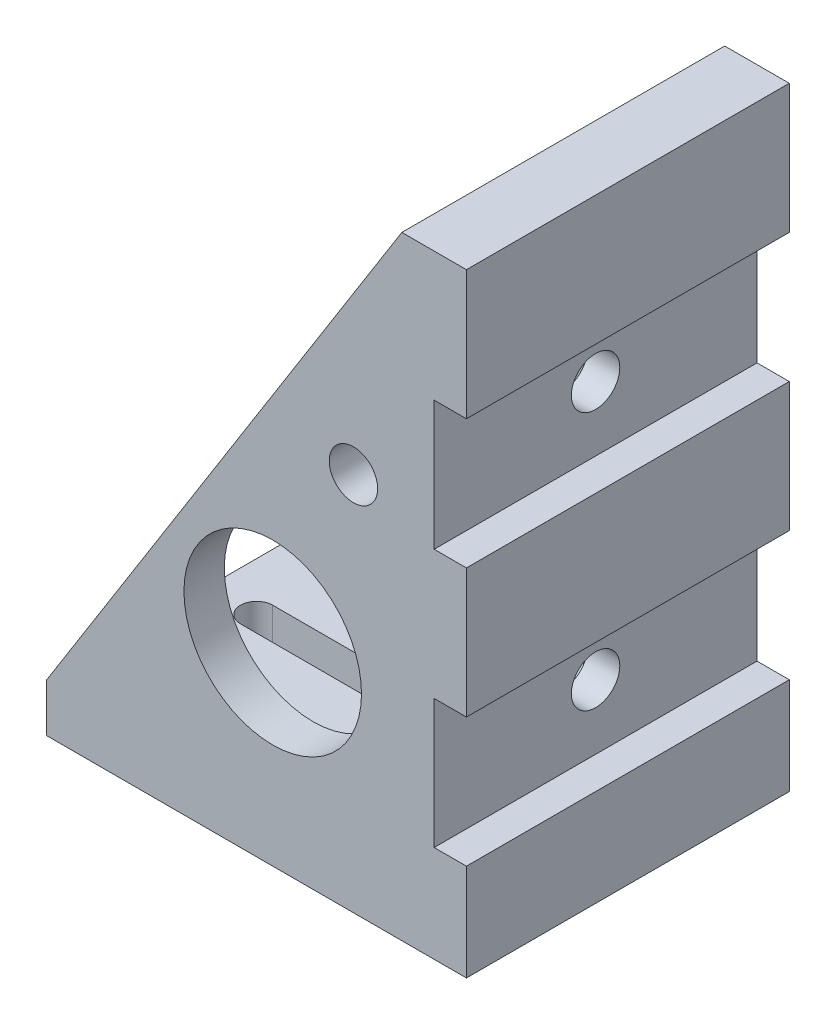
ISO-10303-21;
HEADER;
FILE_DESCRIPTION(('STEP AP214'),'2;1');
FILE_NAME('part.step','',(''),(''),'','','');
FILE_SCHEMA(('AUTOMOTIVE_DESIGN { 1 0 10303 214 1 1 1 1 }'));
ENDSEC;
DATA;
#1=APPLICATION_CONTEXT('core data for automotive mechanical design processes');
#2=APPLICATION_PROTOCOL_DEFINITION('international standard','automotive_design',2000,#1);
#3=PRODUCT_CONTEXT('',#1,'mechanical');
#4=PRODUCT('Part','Part','',(#3));
#5=PRODUCT_RELATED_PRODUCT_CATEGORY('part','',(#4));
#6=PRODUCT_DEFINITION_FORMATION('','',#4);
#7=PRODUCT_DEFINITION_CONTEXT('part definition',#1,'design');
#8=PRODUCT_DEFINITION('design','',#6,#7);
#9=PRODUCT_DEFINITION_SHAPE('','',#8);
#10=(LENGTH_UNIT() NAMED_UNIT(*) SI_UNIT(.MILLI.,.METRE.));
#11=(NAMED_UNIT(*) PLANE_ANGLE_UNIT() SI_UNIT($,.RADIAN.));
#12=(NAMED_UNIT(*) SI_UNIT($,.STERADIAN.) SOLID_ANGLE_UNIT());
#13=UNCERTAINTY_MEASURE_WITH_UNIT(LENGTH_MEASURE(1.E-05),#10,'distance_accuracy_value','');
#14=(GEOMETRIC_REPRESENTATION_CONTEXT(3) GLOBAL_UNCERTAINTY_ASSIGNED_CONTEXT((#13)) GLOBAL_UNIT_ASSIGNED_CONTEXT((#10,
#11,#12)) REPRESENTATION_CONTEXT('',''));
#15=CARTESIAN_POINT('',(0.,0.,0.));
#16=DIRECTION('',(0.,0.,1.));
#17=DIRECTION('',(1.,0.,0.));
#18=AXIS2_PLACEMENT_3D('',#15,#16,#17);
#19=CARTESIAN_POINT('',(-13.,3.,20.));
#20=DIRECTION('',(0.846636549211005,-0.532171545218346,0.));
#21=DIRECTION('',(0.532171545218346,0.846636549211005,0.));
#22=AXIS2_PLACEMENT_3D('',#19,#20,#21);
#23=PLANE('',#22);
#24=DIRECTION('',(0.,0.,-1.));
#25=VECTOR('',#24,1.);
#26=CARTESIAN_POINT('',(9.,38.,20.));
#27=LINE('',#26,#25);
#28=CARTESIAN_POINT('',(9.,38.,20.));
#29=VERTEX_POINT('',#28);
#30=CARTESIAN_POINT('',(9.00000000000001,38.,17.5));
#31=VERTEX_POINT('',#30);
#32=EDGE_CURVE('E342',#29,#31,#27,.T.);
#33=ORIENTED_EDGE('',*,*,#32,.T.);
#34=DIRECTION('',(-0.532171545218346,-0.846636549211005,0.));
#35=VECTOR('',#34,1.);
#36=CARTESIAN_POINT('',(-13.,3.,17.5));
#37=LINE('',#36,#35);
#38=CARTESIAN_POINT('',(-13.,3.,17.5));
#39=VERTEX_POINT('',#38);
#40=EDGE_CURVE('E11',#31,#39,#37,.T.);
#41=ORIENTED_EDGE('',*,*,#40,.T.);
#42=DIRECTION('',(0.,0.,-1.));
#43=VECTOR('',#42,1.);
#44=CARTESIAN_POINT('',(-13.,3.,20.));
#45=LINE('',#44,#43);
#46=CARTESIAN_POINT('',(-13.,3.,20.));
#47=VERTEX_POINT('',#46);
#48=EDGE_CURVE('E338',#47,#39,#45,.T.);
#49=ORIENTED_EDGE('',*,*,#48,.F.);
#50=DIRECTION('',(-0.532171545218346,-0.846636549211005,0.));
#51=VECTOR('',#50,1.);
#52=CARTESIAN_POINT('',(-13.,3.,20.));
#53=LINE('',#52,#51);
#54=EDGE_CURVE('E311',#29,#47,#53,.T.);
#55=ORIENTED_EDGE('',*,*,#54,.F.);
#56=EDGE_LOOP('',(#33,#41,#49,#55));
#57=FACE_BOUND('',#56,.T.);
#58=ADVANCED_FACE('F35',(#57),#23,.F.);
#59=CARTESIAN_POINT('',(13.,0.,20.));
#60=DIRECTION('',(-1.,0.,0.));
#61=DIRECTION('',(0.,0.,1.));
#62=AXIS2_PLACEMENT_3D('',#59,#60,#61);
#63=PLANE('',#62);
#64=DIRECTION('',(0.,1.,0.));
#65=VECTOR('',#64,1.);
#66=CARTESIAN_POINT('',(13.,0.,20.));
#67=LINE('',#66,#65);
#68=CARTESIAN_POINT('',(13.,30.,20.));
#69=VERTEX_POINT('',#68);
#70=CARTESIAN_POINT('',(13.,38.,20.));
#71=VERTEX_POINT('',#70);
#72=EDGE_CURVE('E309',#69,#71,#67,.T.);
#73=ORIENTED_EDGE('',*,*,#72,.F.);
#74=DIRECTION('',(0.,0.,1.));
#75=VECTOR('',#74,1.);
#76=CARTESIAN_POINT('',(13.,30.,20.));
#77=LINE('',#76,#75);
#78=CARTESIAN_POINT('',(13.,30.,0.));
#79=VERTEX_POINT('',#78);
#80=EDGE_CURVE('E260',#79,#69,#77,.T.);
#81=ORIENTED_EDGE('',*,*,#80,.F.);
#82=DIRECTION('',(0.,1.,0.));
#83=VECTOR('',#82,1.);
#84=CARTESIAN_POINT('',(13.,0.,0.));
#85=LINE('',#84,#83);
#86=CARTESIAN_POINT('',(13.,38.,0.));
#87=VERTEX_POINT('',#86);
#88=EDGE_CURVE('E297',#79,#87,#85,.T.);
#89=ORIENTED_EDGE('',*,*,#88,.T.);
#90=DIRECTION('',(0.,0.,-1.));
#91=VECTOR('',#90,1.);
#92=CARTESIAN_POINT('',(13.,38.,20.));
#93=LINE('',#92,#91);
#94=EDGE_CURVE('E345',#71,#87,#93,.T.);
#95=ORIENTED_EDGE('',*,*,#94,.F.);
#96=EDGE_LOOP('',(#73,#81,#89,#95));
#97=FACE_BOUND('',#96,.T.);
#98=ADVANCED_FACE('F372',(#97),#63,.F.);
#99=CARTESIAN_POINT('',(13.,14.,0.));
#100=VERTEX_POINT('',#99);
#101=CARTESIAN_POINT('',(13.,22.,0.));
#102=VERTEX_POINT('',#101);
#103=EDGE_CURVE('E322',#100,#102,#85,.T.);
#104=ORIENTED_EDGE('',*,*,#103,.T.);
#105=DIRECTION('',(0.,0.,-1.));
#106=VECTOR('',#105,1.);
#107=CARTESIAN_POINT('',(13.,22.,20.));
#108=LINE('',#107,#106);
#109=CARTESIAN_POINT('',(13.,22.,20.));
#110=VERTEX_POINT('',#109);
#111=EDGE_CURVE('E254',#110,#102,#108,.T.);
#112=ORIENTED_EDGE('',*,*,#111,.F.);
#113=CARTESIAN_POINT('',(13.,14.,20.));
#114=VERTEX_POINT('',#113);
#115=EDGE_CURVE('E308',#114,#110,#67,.T.);
#116=ORIENTED_EDGE('',*,*,#115,.F.);
#117=DIRECTION('',(0.,0.,1.));
#118=VECTOR('',#117,1.);
#119=CARTESIAN_POINT('',(13.,14.,20.));
#120=LINE('',#119,#118);
#121=EDGE_CURVE('E284',#100,#114,#120,.T.);
#122=ORIENTED_EDGE('',*,*,#121,.F.);
#123=EDGE_LOOP('',(#104,#112,#116,#122));
#124=FACE_BOUND('',#123,.T.);
#125=ADVANCED_FACE('F379',(#124),#63,.F.);
#126=CARTESIAN_POINT('',(13.,0.,0.));
#127=VERTEX_POINT('',#126);
#128=CARTESIAN_POINT('',(13.,6.00000000000001,0.));
#129=VERTEX_POINT('',#128);
#130=EDGE_CURVE('E318',#127,#129,#85,.T.);
#131=ORIENTED_EDGE('',*,*,#130,.T.);
#132=DIRECTION('',(0.,0.,-1.));
#133=VECTOR('',#132,1.);
#134=CARTESIAN_POINT('',(13.,6.00000000000001,20.));
#135=LINE('',#134,#133);
#136=CARTESIAN_POINT('',(13.,6.00000000000001,20.));
#137=VERTEX_POINT('',#136);
#138=EDGE_CURVE('E273',#137,#129,#135,.T.);
#139=ORIENTED_EDGE('',*,*,#138,.F.);
#140=CARTESIAN_POINT('',(13.,0.,20.));
#141=VERTEX_POINT('',#140);
#142=EDGE_CURVE('E304',#141,#137,#67,.T.);
#143=ORIENTED_EDGE('',*,*,#142,.F.);
#144=DIRECTION('',(0.,0.,-1.));
#145=VECTOR('',#144,1.);
#146=CARTESIAN_POINT('',(13.,0.,20.));
#147=LINE('',#146,#145);
#148=EDGE_CURVE('E317',#141,#127,#147,.T.);
#149=ORIENTED_EDGE('',*,*,#148,.T.);
#150=EDGE_LOOP('',(#131,#139,#143,#149));
#151=FACE_BOUND('',#150,.T.);
#152=ADVANCED_FACE('F37',(#151),#63,.F.);
#153=CARTESIAN_POINT('',(9.,38.,20.));
#154=DIRECTION('',(0.,-1.,0.));
#155=DIRECTION('',(0.,0.,-1.));
#156=AXIS2_PLACEMENT_3D('',#153,#154,#155);
#157=PLANE('',#156);
#158=DIRECTION('',(-1.,0.,0.));
#159=VECTOR('',#158,1.);
#160=CARTESIAN_POINT('',(9.,38.,0.));
#161=LINE('',#160,#159);
#162=CARTESIAN_POINT('',(9.,38.,0.));
#163=VERTEX_POINT('',#162);
#164=EDGE_CURVE('E321',#87,#163,#161,.T.);
#165=ORIENTED_EDGE('',*,*,#164,.T.);
#166=CARTESIAN_POINT('',(9.00000000000001,38.,2.5));
#167=VERTEX_POINT('',#166);
#168=EDGE_CURVE('E341',#167,#163,#27,.T.);
#169=ORIENTED_EDGE('',*,*,#168,.F.);
#170=DIRECTION('',(0.,0.,-1.));
#171=VECTOR('',#170,1.);
#172=CARTESIAN_POINT('',(9.00000000000001,38.,2.5));
#173=LINE('',#172,#171);
#174=EDGE_CURVE('E237',#31,#167,#173,.T.);
#175=ORIENTED_EDGE('',*,*,#174,.F.);
#176=ORIENTED_EDGE('',*,*,#32,.F.);
#177=DIRECTION('',(-1.,0.,0.));
#178=VECTOR('',#177,1.);
#179=CARTESIAN_POINT('',(9.,38.,20.));
#180=LINE('',#179,#178);
#181=EDGE_CURVE('E307',#71,#29,#180,.T.);
#182=ORIENTED_EDGE('',*,*,#181,.F.);
#183=ORIENTED_EDGE('',*,*,#94,.T.);
#184=EDGE_LOOP('',(#165,#169,#175,#176,#182,#183));
#185=FACE_BOUND('',#184,.T.);
#186=ADVANCED_FACE('F384',(#185),#157,.F.);
#187=CARTESIAN_POINT('',(-13.,3.,2.5));
#188=VERTEX_POINT('',#187);
#189=CARTESIAN_POINT('',(-13.,3.,0.));
#190=VERTEX_POINT('',#189);
#191=EDGE_CURVE('E337',#188,#190,#45,.T.);
#192=ORIENTED_EDGE('',*,*,#191,.F.);
#193=DIRECTION('',(0.532171545218346,0.846636549211005,0.));
#194=VECTOR('',#193,1.);
#195=CARTESIAN_POINT('',(-13.,3.,2.5));
#196=LINE('',#195,#194);
#197=EDGE_CURVE('E44',#188,#167,#196,.T.);
#198=ORIENTED_EDGE('',*,*,#197,.T.);
#199=ORIENTED_EDGE('',*,*,#168,.T.);
#200=DIRECTION('',(-0.532171545218346,-0.846636549211005,0.));
#201=VECTOR('',#200,1.);
#202=CARTESIAN_POINT('',(-13.,3.,0.));
#203=LINE('',#202,#201);
#204=EDGE_CURVE('E325',#163,#190,#203,.T.);
#205=ORIENTED_EDGE('',*,*,#204,.T.);
#206=EDGE_LOOP('',(#192,#198,#199,#205));
#207=FACE_BOUND('',#206,.T.);
#208=ADVANCED_FACE('F375',(#207),#23,.F.);
#209=CARTESIAN_POINT('',(-13.,0.,20.));
#210=DIRECTION('',(1.,0.,0.));
#211=DIRECTION('',(0.,0.,-1.));
#212=AXIS2_PLACEMENT_3D('',#209,#210,#211);
#213=PLANE('',#212);
#214=DIRECTION('',(0.,-1.,0.));
#215=VECTOR('',#214,1.);
#216=CARTESIAN_POINT('',(-13.,0.,0.));
#217=LINE('',#216,#215);
#218=CARTESIAN_POINT('',(-13.,0.,0.));
#219=VERTEX_POINT('',#218);
#220=EDGE_CURVE('E328',#190,#219,#217,.T.);
#221=ORIENTED_EDGE('',*,*,#220,.T.);
#222=DIRECTION('',(0.,0.,-1.));
#223=VECTOR('',#222,1.);
#224=CARTESIAN_POINT('',(-13.,0.,20.));
#225=LINE('',#224,#223);
#226=CARTESIAN_POINT('',(-13.,0.,20.));
#227=VERTEX_POINT('',#226);
#228=EDGE_CURVE('E334',#227,#219,#225,.T.);
#229=ORIENTED_EDGE('',*,*,#228,.F.);
#230=DIRECTION('',(0.,-1.,0.));
#231=VECTOR('',#230,1.);
#232=CARTESIAN_POINT('',(-13.,0.,20.));
#233=LINE('',#232,#231);
#234=EDGE_CURVE('E313',#47,#227,#233,.T.);
#235=ORIENTED_EDGE('',*,*,#234,.F.);
#236=ORIENTED_EDGE('',*,*,#48,.T.);
#237=DIRECTION('',(0.,0.,1.));
#238=VECTOR('',#237,1.);
#239=CARTESIAN_POINT('',(-13.,3.,2.5));
#240=LINE('',#239,#238);
#241=EDGE_CURVE('E236',#188,#39,#240,.T.);
#242=ORIENTED_EDGE('',*,*,#241,.F.);
#243=ORIENTED_EDGE('',*,*,#191,.T.);
#244=EDGE_LOOP('',(#221,#229,#235,#236,#242,#243));
#245=FACE_BOUND('',#244,.T.);
#246=ADVANCED_FACE('F383',(#245),#213,.F.);
#247=CARTESIAN_POINT('',(-13.,0.,20.));
#248=DIRECTION('',(0.,1.,0.));
#249=DIRECTION('',(-1.,0.,0.));
#250=AXIS2_PLACEMENT_3D('',#247,#248,#249);
#251=PLANE('',#250);
#252=DIRECTION('',(1.,0.,0.));
#253=VECTOR('',#252,1.);
#254=CARTESIAN_POINT('',(-10.,0.,9.));
#255=LINE('',#254,#253);
#256=CARTESIAN_POINT('',(-10.,0.,9.));
#257=VERTEX_POINT('',#256);
#258=CARTESIAN_POINT('',(6.,0.,9.));
#259=VERTEX_POINT('',#258);
#260=EDGE_CURVE('E477',#257,#259,#255,.T.);
#261=ORIENTED_EDGE('',*,*,#260,.F.);
#262=CARTESIAN_POINT('',(-10.,0.,10.));
#263=DIRECTION('',(0.,1.,0.));
#264=DIRECTION('',(-1.,0.,0.));
#265=AXIS2_PLACEMENT_3D('',#262,#263,#264);
#266=CIRCLE('',#265,1.);
#267=CARTESIAN_POINT('',(-10.,0.,11.));
#268=VERTEX_POINT('',#267);
#269=EDGE_CURVE('E205',#268,#257,#266,.F.);
#270=ORIENTED_EDGE('',*,*,#269,.F.);
#271=DIRECTION('',(-1.,0.,0.));
#272=VECTOR('',#271,1.);
#273=CARTESIAN_POINT('',(-10.,0.,11.));
#274=LINE('',#273,#272);
#275=CARTESIAN_POINT('',(6.,0.,11.));
#276=VERTEX_POINT('',#275);
#277=EDGE_CURVE('E202',#276,#268,#274,.T.);
#278=ORIENTED_EDGE('',*,*,#277,.F.);
#279=CARTESIAN_POINT('',(6.,0.,10.));
#280=DIRECTION('',(0.,1.,0.));
#281=DIRECTION('',(-1.,0.,0.));
#282=AXIS2_PLACEMENT_3D('',#279,#280,#281);
#283=CIRCLE('',#282,1.);
#284=EDGE_CURVE('E180',#259,#276,#283,.F.);
#285=ORIENTED_EDGE('',*,*,#284,.F.);
#286=EDGE_LOOP('',(#261,#270,#278,#285));
#287=FACE_BOUND('',#286,.T.);
#288=DIRECTION('',(1.,0.,0.));
#289=VECTOR('',#288,1.);
#290=CARTESIAN_POINT('',(-13.,0.,0.));
#291=LINE('',#290,#289);
#292=EDGE_CURVE('E330',#219,#127,#291,.T.);
#293=ORIENTED_EDGE('',*,*,#292,.T.);
#294=ORIENTED_EDGE('',*,*,#148,.F.);
#295=DIRECTION('',(1.,0.,0.));
#296=VECTOR('',#295,1.);
#297=CARTESIAN_POINT('',(-13.,0.,20.));
#298=LINE('',#297,#296);
#299=EDGE_CURVE('E315',#227,#141,#298,.T.);
#300=ORIENTED_EDGE('',*,*,#299,.F.);
#301=ORIENTED_EDGE('',*,*,#228,.T.);
#302=EDGE_LOOP('',(#293,#294,#300,#301));
#303=FACE_BOUND('',#302,.T.);
#304=ADVANCED_FACE('F390',(#287,#303),#251,.F.);
#305=CARTESIAN_POINT('',(0.,0.,20.));
#306=DIRECTION('',(0.,0.,-1.));
#307=DIRECTION('',(-1.,0.,0.));
#308=AXIS2_PLACEMENT_3D('',#305,#306,#307);
#309=PLANE('',#308);
#310=CARTESIAN_POINT('',(0.999999999999999,12.,20.));
#311=DIRECTION('',(0.,0.,1.));
#312=DIRECTION('',(1.,0.,0.));
#313=AXIS2_PLACEMENT_3D('',#310,#311,#312);
#314=CIRCLE('',#313,5.5);
#315=CARTESIAN_POINT('',(6.5,12.,20.));
#316=VERTEX_POINT('',#315);
#317=EDGE_CURVE('E217',#316,#316,#314,.T.);
#318=ORIENTED_EDGE('',*,*,#317,.F.);
#319=EDGE_LOOP('',(#318));
#320=FACE_BOUND('',#319,.T.);
#321=CARTESIAN_POINT('',(6.,23.5,20.));
#322=DIRECTION('',(0.,0.,1.));
#323=DIRECTION('',(1.,0.,0.));
#324=AXIS2_PLACEMENT_3D('',#321,#322,#323);
#325=CIRCLE('',#324,1.5);
#326=CARTESIAN_POINT('',(7.5,23.5,20.));
#327=VERTEX_POINT('',#326);
#328=EDGE_CURVE('E226',#327,#327,#325,.T.);
#329=ORIENTED_EDGE('',*,*,#328,.F.);
#330=EDGE_LOOP('',(#329));
#331=FACE_BOUND('',#330,.T.);
#332=DIRECTION('',(0.,-1.,0.));
#333=VECTOR('',#332,1.);
#334=CARTESIAN_POINT('',(11.,22.,20.));
#335=LINE('',#334,#333);
#336=CARTESIAN_POINT('',(11.,30.,20.));
#337=VERTEX_POINT('',#336);
#338=CARTESIAN_POINT('',(11.,22.,20.));
#339=VERTEX_POINT('',#338);
#340=EDGE_CURVE('E256',#337,#339,#335,.T.);
#341=ORIENTED_EDGE('',*,*,#340,.F.);
#342=DIRECTION('',(1.,0.,0.));
#343=VECTOR('',#342,1.);
#344=CARTESIAN_POINT('',(11.,30.,20.));
#345=LINE('',#344,#343);
#346=EDGE_CURVE('E270',#337,#69,#345,.T.);
#347=ORIENTED_EDGE('',*,*,#346,.T.);
#348=ORIENTED_EDGE('',*,*,#72,.T.);
#349=ORIENTED_EDGE('',*,*,#181,.T.);
#350=ORIENTED_EDGE('',*,*,#54,.T.);
#351=ORIENTED_EDGE('',*,*,#234,.T.);
#352=ORIENTED_EDGE('',*,*,#299,.T.);
#353=ORIENTED_EDGE('',*,*,#142,.T.);
#354=DIRECTION('',(1.,0.,0.));
#355=VECTOR('',#354,1.);
#356=CARTESIAN_POINT('',(11.,6.00000000000001,20.));
#357=LINE('',#356,#355);
#358=CARTESIAN_POINT('',(11.,6.00000000000001,20.));
#359=VERTEX_POINT('',#358);
#360=EDGE_CURVE('E291',#359,#137,#357,.T.);
#361=ORIENTED_EDGE('',*,*,#360,.F.);
#362=DIRECTION('',(0.,-1.,0.));
#363=VECTOR('',#362,1.);
#364=CARTESIAN_POINT('',(11.,14.,20.));
#365=LINE('',#364,#363);
#366=CARTESIAN_POINT('',(11.,14.,20.));
#367=VERTEX_POINT('',#366);
#368=EDGE_CURVE('E280',#367,#359,#365,.T.);
#369=ORIENTED_EDGE('',*,*,#368,.F.);
#370=DIRECTION('',(1.,0.,0.));
#371=VECTOR('',#370,1.);
#372=CARTESIAN_POINT('',(11.,14.,20.));
#373=LINE('',#372,#371);
#374=EDGE_CURVE('E294',#367,#114,#373,.T.);
#375=ORIENTED_EDGE('',*,*,#374,.T.);
#376=ORIENTED_EDGE('',*,*,#115,.T.);
#377=DIRECTION('',(1.,0.,0.));
#378=VECTOR('',#377,1.);
#379=CARTESIAN_POINT('',(11.,22.,20.));
#380=LINE('',#379,#378);
#381=EDGE_CURVE('E267',#339,#110,#380,.T.);
#382=ORIENTED_EDGE('',*,*,#381,.F.);
#383=EDGE_LOOP('',(#341,#347,#348,#349,#350,#351,#352,#353,#361,#369,#375,#376,#382));
#384=FACE_BOUND('',#383,.T.);
#385=ADVANCED_FACE('F425',(#320,#331,#384),#309,.F.);
#386=CARTESIAN_POINT('',(0.,0.,0.));
#387=DIRECTION('',(0.,0.,-1.));
#388=DIRECTION('',(-1.,0.,0.));
#389=AXIS2_PLACEMENT_3D('',#386,#387,#388);
#390=PLANE('',#389);
#391=CARTESIAN_POINT('',(0.999999999999999,12.,0.));
#392=DIRECTION('',(0.,0.,-1.));
#393=DIRECTION('',(-1.,0.,0.));
#394=AXIS2_PLACEMENT_3D('',#391,#392,#393);
#395=CIRCLE('',#394,5.5);
#396=CARTESIAN_POINT('',(-4.5,12.,0.));
#397=VERTEX_POINT('',#396);
#398=EDGE_CURVE('E220',#397,#397,#395,.F.);
#399=ORIENTED_EDGE('',*,*,#398,.T.);
#400=EDGE_LOOP('',(#399));
#401=FACE_BOUND('',#400,.T.);
#402=CARTESIAN_POINT('',(6.,23.5,0.));
#403=DIRECTION('',(0.,0.,-1.));
#404=DIRECTION('',(-1.,0.,0.));
#405=AXIS2_PLACEMENT_3D('',#402,#403,#404);
#406=CIRCLE('',#405,1.5);
#407=CARTESIAN_POINT('',(4.5,23.5,0.));
#408=VERTEX_POINT('',#407);
#409=EDGE_CURVE('E229',#408,#408,#406,.F.);
#410=ORIENTED_EDGE('',*,*,#409,.T.);
#411=EDGE_LOOP('',(#410));
#412=FACE_BOUND('',#411,.T.);
#413=DIRECTION('',(1.,0.,0.));
#414=VECTOR('',#413,1.);
#415=CARTESIAN_POINT('',(11.,30.,0.));
#416=LINE('',#415,#414);
#417=CARTESIAN_POINT('',(11.,30.,0.));
#418=VERTEX_POINT('',#417);
#419=EDGE_CURVE('E274',#418,#79,#416,.T.);
#420=ORIENTED_EDGE('',*,*,#419,.F.);
#421=DIRECTION('',(0.,1.,0.));
#422=VECTOR('',#421,1.);
#423=CARTESIAN_POINT('',(11.,22.,0.));
#424=LINE('',#423,#422);
#425=CARTESIAN_POINT('',(11.,22.,0.));
#426=VERTEX_POINT('',#425);
#427=EDGE_CURVE('E262',#426,#418,#424,.T.);
#428=ORIENTED_EDGE('',*,*,#427,.F.);
#429=DIRECTION('',(1.,0.,0.));
#430=VECTOR('',#429,1.);
#431=CARTESIAN_POINT('',(11.,22.,0.));
#432=LINE('',#431,#430);
#433=EDGE_CURVE('E276',#426,#102,#432,.T.);
#434=ORIENTED_EDGE('',*,*,#433,.T.);
#435=ORIENTED_EDGE('',*,*,#103,.F.);
#436=DIRECTION('',(1.,0.,0.));
#437=VECTOR('',#436,1.);
#438=CARTESIAN_POINT('',(11.,14.,0.));
#439=LINE('',#438,#437);
#440=CARTESIAN_POINT('',(11.,14.,0.));
#441=VERTEX_POINT('',#440);
#442=EDGE_CURVE('E298',#441,#100,#439,.T.);
#443=ORIENTED_EDGE('',*,*,#442,.F.);
#444=DIRECTION('',(0.,1.,0.));
#445=VECTOR('',#444,1.);
#446=CARTESIAN_POINT('',(11.,14.,0.));
#447=LINE('',#446,#445);
#448=CARTESIAN_POINT('',(11.,6.00000000000001,0.));
#449=VERTEX_POINT('',#448);
#450=EDGE_CURVE('E286',#449,#441,#447,.T.);
#451=ORIENTED_EDGE('',*,*,#450,.F.);
#452=DIRECTION('',(1.,0.,0.));
#453=VECTOR('',#452,1.);
#454=CARTESIAN_POINT('',(11.,6.00000000000001,0.));
#455=LINE('',#454,#453);
#456=EDGE_CURVE('E300',#449,#129,#455,.T.);
#457=ORIENTED_EDGE('',*,*,#456,.T.);
#458=ORIENTED_EDGE('',*,*,#130,.F.);
#459=ORIENTED_EDGE('',*,*,#292,.F.);
#460=ORIENTED_EDGE('',*,*,#220,.F.);
#461=ORIENTED_EDGE('',*,*,#204,.F.);
#462=ORIENTED_EDGE('',*,*,#164,.F.);
#463=ORIENTED_EDGE('',*,*,#88,.F.);
#464=EDGE_LOOP('',(#420,#428,#434,#435,#443,#451,#457,#458,#459,#460,#461,#462,#463));
#465=FACE_BOUND('',#464,.T.);
#466=ADVANCED_FACE('F415',(#401,#412,#465),#390,.T.);
#467=CARTESIAN_POINT('',(11.,14.,20.));
#468=DIRECTION('',(0.,1.,0.));
#469=DIRECTION('',(0.,0.,1.));
#470=AXIS2_PLACEMENT_3D('',#467,#468,#469);
#471=PLANE('',#470);
#472=ORIENTED_EDGE('',*,*,#121,.T.);
#473=ORIENTED_EDGE('',*,*,#374,.F.);
#474=DIRECTION('',(0.,0.,1.));
#475=VECTOR('',#474,1.);
#476=CARTESIAN_POINT('',(11.,14.,20.));
#477=LINE('',#476,#475);
#478=EDGE_CURVE('E288',#441,#367,#477,.T.);
#479=ORIENTED_EDGE('',*,*,#478,.F.);
#480=ORIENTED_EDGE('',*,*,#442,.T.);
#481=EDGE_LOOP('',(#472,#473,#479,#480));
#482=FACE_BOUND('',#481,.T.);
#483=ADVANCED_FACE('F446',(#482),#471,.F.);
#484=CARTESIAN_POINT('',(11.,6.00000000000001,20.));
#485=DIRECTION('',(0.,-1.,0.));
#486=DIRECTION('',(0.,0.,-1.));
#487=AXIS2_PLACEMENT_3D('',#484,#485,#486);
#488=PLANE('',#487);
#489=ORIENTED_EDGE('',*,*,#138,.T.);
#490=ORIENTED_EDGE('',*,*,#456,.F.);
#491=DIRECTION('',(0.,0.,-1.));
#492=VECTOR('',#491,1.);
#493=CARTESIAN_POINT('',(11.,6.00000000000001,20.));
#494=LINE('',#493,#492);
#495=EDGE_CURVE('E283',#359,#449,#494,.T.);
#496=ORIENTED_EDGE('',*,*,#495,.F.);
#497=ORIENTED_EDGE('',*,*,#360,.T.);
#498=EDGE_LOOP('',(#489,#490,#496,#497));
#499=FACE_BOUND('',#498,.T.);
#500=ADVANCED_FACE('F453',(#499),#488,.F.);
#501=CARTESIAN_POINT('',(11.,0.,0.));
#502=DIRECTION('',(1.,0.,0.));
#503=DIRECTION('',(0.,0.,-1.));
#504=AXIS2_PLACEMENT_3D('',#501,#502,#503);
#505=PLANE('',#504);
#506=CARTESIAN_POINT('',(11.,10.,10.));
#507=DIRECTION('',(1.,0.,0.));
#508=DIRECTION('',(0.,0.,-1.));
#509=AXIS2_PLACEMENT_3D('',#506,#507,#508);
#510=CIRCLE('',#509,1.5);
#511=CARTESIAN_POINT('',(11.,10.,8.5));
#512=VERTEX_POINT('',#511);
#513=EDGE_CURVE('E204',#512,#512,#510,.T.);
#514=ORIENTED_EDGE('',*,*,#513,.F.);
#515=EDGE_LOOP('',(#514));
#516=FACE_BOUND('',#515,.T.);
#517=ORIENTED_EDGE('',*,*,#368,.T.);
#518=ORIENTED_EDGE('',*,*,#495,.T.);
#519=ORIENTED_EDGE('',*,*,#450,.T.);
#520=ORIENTED_EDGE('',*,*,#478,.T.);
#521=EDGE_LOOP('',(#517,#518,#519,#520));
#522=FACE_BOUND('',#521,.T.);
#523=ADVANCED_FACE('F448',(#516,#522),#505,.T.);
#524=CARTESIAN_POINT('',(11.,30.,20.));
#525=DIRECTION('',(0.,1.,0.));
#526=DIRECTION('',(0.,0.,1.));
#527=AXIS2_PLACEMENT_3D('',#524,#525,#526);
#528=PLANE('',#527);
#529=ORIENTED_EDGE('',*,*,#80,.T.);
#530=ORIENTED_EDGE('',*,*,#346,.F.);
#531=DIRECTION('',(0.,0.,1.));
#532=VECTOR('',#531,1.);
#533=CARTESIAN_POINT('',(11.,30.,20.));
#534=LINE('',#533,#532);
#535=EDGE_CURVE('E264',#418,#337,#534,.T.);
#536=ORIENTED_EDGE('',*,*,#535,.F.);
#537=ORIENTED_EDGE('',*,*,#419,.T.);
#538=EDGE_LOOP('',(#529,#530,#536,#537));
#539=FACE_BOUND('',#538,.T.);
#540=ADVANCED_FACE('F460',(#539),#528,.F.);
#541=CARTESIAN_POINT('',(11.,22.,20.));
#542=DIRECTION('',(0.,-1.,0.));
#543=DIRECTION('',(0.,0.,-1.));
#544=AXIS2_PLACEMENT_3D('',#541,#542,#543);
#545=PLANE('',#544);
#546=ORIENTED_EDGE('',*,*,#111,.T.);
#547=ORIENTED_EDGE('',*,*,#433,.F.);
#548=DIRECTION('',(0.,0.,-1.));
#549=VECTOR('',#548,1.);
#550=CARTESIAN_POINT('',(11.,22.,20.));
#551=LINE('',#550,#549);
#552=EDGE_CURVE('E259',#339,#426,#551,.T.);
#553=ORIENTED_EDGE('',*,*,#552,.F.);
#554=ORIENTED_EDGE('',*,*,#381,.T.);
#555=EDGE_LOOP('',(#546,#547,#553,#554));
#556=FACE_BOUND('',#555,.T.);
#557=ADVANCED_FACE('F441',(#556),#545,.F.);
#558=CARTESIAN_POINT('',(11.,0.,0.));
#559=DIRECTION('',(-1.,0.,0.));
#560=DIRECTION('',(0.,0.,1.));
#561=AXIS2_PLACEMENT_3D('',#558,#559,#560);
#562=PLANE('',#561);
#563=CARTESIAN_POINT('',(11.,26.,10.));
#564=DIRECTION('',(1.,0.,0.));
#565=DIRECTION('',(0.,0.,-1.));
#566=AXIS2_PLACEMENT_3D('',#563,#564,#565);
#567=CIRCLE('',#566,1.5);
#568=CARTESIAN_POINT('',(11.,26.,8.5));
#569=VERTEX_POINT('',#568);
#570=EDGE_CURVE('E211',#569,#569,#567,.T.);
#571=ORIENTED_EDGE('',*,*,#570,.F.);
#572=EDGE_LOOP('',(#571));
#573=FACE_BOUND('',#572,.T.);
#574=ORIENTED_EDGE('',*,*,#340,.T.);
#575=ORIENTED_EDGE('',*,*,#552,.T.);
#576=ORIENTED_EDGE('',*,*,#427,.T.);
#577=ORIENTED_EDGE('',*,*,#535,.T.);
#578=EDGE_LOOP('',(#574,#575,#576,#577));
#579=FACE_BOUND('',#578,.T.);
#580=ADVANCED_FACE('F516',(#573,#579),#562,.F.);
#581=CARTESIAN_POINT('',(9.00000000000001,3.,17.5));
#582=DIRECTION('',(0.,0.,1.));
#583=DIRECTION('',(1.,0.,0.));
#584=AXIS2_PLACEMENT_3D('',#581,#582,#583);
#585=PLANE('',#584);
#586=CARTESIAN_POINT('',(0.999999999999999,12.,17.5));
#587=DIRECTION('',(0.,0.,1.));
#588=DIRECTION('',(1.,0.,0.));
#589=AXIS2_PLACEMENT_3D('',#586,#587,#588);
#590=CIRCLE('',#589,5.5);
#591=CARTESIAN_POINT('',(6.5,12.,17.5));
#592=VERTEX_POINT('',#591);
#593=EDGE_CURVE('E223',#592,#592,#590,.T.);
#594=ORIENTED_EDGE('',*,*,#593,.T.);
#595=EDGE_LOOP('',(#594));
#596=FACE_BOUND('',#595,.T.);
#597=CARTESIAN_POINT('',(6.,23.5,17.5));
#598=DIRECTION('',(0.,0.,1.));
#599=DIRECTION('',(1.,0.,0.));
#600=AXIS2_PLACEMENT_3D('',#597,#598,#599);
#601=CIRCLE('',#600,1.5);
#602=CARTESIAN_POINT('',(7.5,23.5,17.5));
#603=VERTEX_POINT('',#602);
#604=EDGE_CURVE('E233',#603,#603,#601,.T.);
#605=ORIENTED_EDGE('',*,*,#604,.T.);
#606=EDGE_LOOP('',(#605));
#607=FACE_BOUND('',#606,.T.);
#608=DIRECTION('',(0.,1.,0.));
#609=VECTOR('',#608,1.);
#610=CARTESIAN_POINT('',(9.00000000000001,3.,17.5));
#611=LINE('',#610,#609);
#612=CARTESIAN_POINT('',(9.00000000000001,3.,17.5));
#613=VERTEX_POINT('',#612);
#614=EDGE_CURVE('E246',#613,#31,#611,.T.);
#615=ORIENTED_EDGE('',*,*,#614,.F.);
#616=DIRECTION('',(-1.,0.,0.));
#617=VECTOR('',#616,1.);
#618=CARTESIAN_POINT('',(9.00000000000001,3.,17.5));
#619=LINE('',#618,#617);
#620=EDGE_CURVE('E252',#613,#39,#619,.T.);
#621=ORIENTED_EDGE('',*,*,#620,.T.);
#622=ORIENTED_EDGE('',*,*,#40,.F.);
#623=EDGE_LOOP('',(#615,#621,#622));
#624=FACE_BOUND('',#623,.T.);
#625=ADVANCED_FACE('F406',(#596,#607,#624),#585,.F.);
#626=CARTESIAN_POINT('',(9.00000000000001,38.,2.5));
#627=DIRECTION('',(0.,0.,-1.));
#628=DIRECTION('',(-1.,0.,0.));
#629=AXIS2_PLACEMENT_3D('',#626,#627,#628);
#630=PLANE('',#629);
#631=CARTESIAN_POINT('',(0.999999999999999,12.,2.5));
#632=DIRECTION('',(0.,0.,-1.));
#633=DIRECTION('',(-1.,0.,0.));
#634=AXIS2_PLACEMENT_3D('',#631,#632,#633);
#635=CIRCLE('',#634,5.5);
#636=CARTESIAN_POINT('',(-4.5,12.,2.5));
#637=VERTEX_POINT('',#636);
#638=EDGE_CURVE('E39',#637,#637,#635,.T.);
#639=ORIENTED_EDGE('',*,*,#638,.T.);
#640=EDGE_LOOP('',(#639));
#641=FACE_BOUND('',#640,.T.);
#642=CARTESIAN_POINT('',(6.,23.5,2.5));
#643=DIRECTION('',(0.,0.,-1.));
#644=DIRECTION('',(-1.,0.,0.));
#645=AXIS2_PLACEMENT_3D('',#642,#643,#644);
#646=CIRCLE('',#645,1.5);
#647=CARTESIAN_POINT('',(4.5,23.5,2.5));
#648=VERTEX_POINT('',#647);
#649=EDGE_CURVE('E232',#648,#648,#646,.T.);
#650=ORIENTED_EDGE('',*,*,#649,.T.);
#651=EDGE_LOOP('',(#650));
#652=FACE_BOUND('',#651,.T.);
#653=DIRECTION('',(-1.,0.,0.));
#654=VECTOR('',#653,1.);
#655=CARTESIAN_POINT('',(9.00000000000001,3.,2.5));
#656=LINE('',#655,#654);
#657=CARTESIAN_POINT('',(9.00000000000001,3.,2.5));
#658=VERTEX_POINT('',#657);
#659=EDGE_CURVE('E249',#658,#188,#656,.T.);
#660=ORIENTED_EDGE('',*,*,#659,.F.);
#661=DIRECTION('',(0.,-1.,0.));
#662=VECTOR('',#661,1.);
#663=CARTESIAN_POINT('',(9.00000000000001,38.,2.5));
#664=LINE('',#663,#662);
#665=EDGE_CURVE('E240',#167,#658,#664,.T.);
#666=ORIENTED_EDGE('',*,*,#665,.F.);
#667=ORIENTED_EDGE('',*,*,#197,.F.);
#668=EDGE_LOOP('',(#660,#666,#667));
#669=FACE_BOUND('',#668,.T.);
#670=ADVANCED_FACE('F352',(#641,#652,#669),#630,.F.);
#671=CARTESIAN_POINT('',(9.00000000000001,3.,2.5));
#672=DIRECTION('',(0.,-1.,0.));
#673=DIRECTION('',(0.,0.,-1.));
#674=AXIS2_PLACEMENT_3D('',#671,#672,#673);
#675=PLANE('',#674);
#676=DIRECTION('',(1.,0.,0.));
#677=VECTOR('',#676,1.);
#678=CARTESIAN_POINT('',(-10.,3.,11.));
#679=LINE('',#678,#677);
#680=CARTESIAN_POINT('',(-9.99999999999999,3.,11.));
#681=VERTEX_POINT('',#680);
#682=CARTESIAN_POINT('',(6.,3.,11.));
#683=VERTEX_POINT('',#682);
#684=EDGE_CURVE('E186',#681,#683,#679,.T.);
#685=ORIENTED_EDGE('',*,*,#684,.F.);
#686=CARTESIAN_POINT('',(-10.,3.,10.));
#687=DIRECTION('',(0.,1.,0.));
#688=DIRECTION('',(0.,0.,1.));
#689=AXIS2_PLACEMENT_3D('',#686,#687,#688);
#690=CIRCLE('',#689,1.);
#691=CARTESIAN_POINT('',(-10.,3.,9.));
#692=VERTEX_POINT('',#691);
#693=EDGE_CURVE('E60',#692,#681,#690,.T.);
#694=ORIENTED_EDGE('',*,*,#693,.F.);
#695=DIRECTION('',(-1.,0.,0.));
#696=VECTOR('',#695,1.);
#697=CARTESIAN_POINT('',(-10.,3.,9.));
#698=LINE('',#697,#696);
#699=CARTESIAN_POINT('',(6.,3.,9.));
#700=VERTEX_POINT('',#699);
#701=EDGE_CURVE('E193',#700,#692,#698,.T.);
#702=ORIENTED_EDGE('',*,*,#701,.F.);
#703=CARTESIAN_POINT('',(6.,3.,10.));
#704=DIRECTION('',(0.,1.,0.));
#705=DIRECTION('',(0.,0.,1.));
#706=AXIS2_PLACEMENT_3D('',#703,#704,#705);
#707=CIRCLE('',#706,1.);
#708=EDGE_CURVE('E177',#683,#700,#707,.T.);
#709=ORIENTED_EDGE('',*,*,#708,.F.);
#710=EDGE_LOOP('',(#685,#694,#702,#709));
#711=FACE_BOUND('',#710,.T.);
#712=ORIENTED_EDGE('',*,*,#241,.T.);
#713=ORIENTED_EDGE('',*,*,#620,.F.);
#714=DIRECTION('',(0.,0.,1.));
#715=VECTOR('',#714,1.);
#716=CARTESIAN_POINT('',(9.00000000000001,3.,2.5));
#717=LINE('',#716,#715);
#718=EDGE_CURVE('E243',#658,#613,#717,.T.);
#719=ORIENTED_EDGE('',*,*,#718,.F.);
#720=ORIENTED_EDGE('',*,*,#659,.T.);
#721=EDGE_LOOP('',(#712,#713,#719,#720));
#722=FACE_BOUND('',#721,.T.);
#723=ADVANCED_FACE('F190',(#711,#722),#675,.F.);
#724=CARTESIAN_POINT('',(9.00000000000001,0.,0.));
#725=DIRECTION('',(-1.,0.,0.));
#726=DIRECTION('',(0.,0.,1.));
#727=AXIS2_PLACEMENT_3D('',#724,#725,#726);
#728=PLANE('',#727);
#729=CARTESIAN_POINT('',(9.00000000000001,10.,10.));
#730=DIRECTION('',(-1.,0.,0.));
#731=DIRECTION('',(0.,0.,1.));
#732=AXIS2_PLACEMENT_3D('',#729,#730,#731);
#733=CIRCLE('',#732,1.5);
#734=CARTESIAN_POINT('',(9.00000000000001,10.,11.5));
#735=VERTEX_POINT('',#734);
#736=EDGE_CURVE('E208',#735,#735,#733,.F.);
#737=ORIENTED_EDGE('',*,*,#736,.T.);
#738=EDGE_LOOP('',(#737));
#739=FACE_BOUND('',#738,.T.);
#740=CARTESIAN_POINT('',(9.00000000000001,26.,10.));
#741=DIRECTION('',(-1.,0.,0.));
#742=DIRECTION('',(0.,0.,1.));
#743=AXIS2_PLACEMENT_3D('',#740,#741,#742);
#744=CIRCLE('',#743,1.5);
#745=CARTESIAN_POINT('',(9.00000000000001,26.,11.5));
#746=VERTEX_POINT('',#745);
#747=EDGE_CURVE('E214',#746,#746,#744,.F.);
#748=ORIENTED_EDGE('',*,*,#747,.T.);
#749=EDGE_LOOP('',(#748));
#750=FACE_BOUND('',#749,.T.);
#751=ORIENTED_EDGE('',*,*,#174,.T.);
#752=ORIENTED_EDGE('',*,*,#665,.T.);
#753=ORIENTED_EDGE('',*,*,#718,.T.);
#754=ORIENTED_EDGE('',*,*,#614,.T.);
#755=EDGE_LOOP('',(#751,#752,#753,#754));
#756=FACE_BOUND('',#755,.T.);
#757=ADVANCED_FACE('F358',(#739,#750,#756),#728,.T.);
#758=CARTESIAN_POINT('',(6.,23.5,-15.556349186104));
#759=DIRECTION('',(0.,0.,1.));
#760=DIRECTION('',(1.,0.,0.));
#761=AXIS2_PLACEMENT_3D('',#758,#759,#760);
#762=CYLINDRICAL_SURFACE('',#761,1.5);
#763=ORIENTED_EDGE('',*,*,#409,.F.);
#764=EDGE_LOOP('',(#763));
#765=FACE_BOUND('',#764,.T.);
#766=ORIENTED_EDGE('',*,*,#649,.F.);
#767=EDGE_LOOP('',(#766));
#768=FACE_BOUND('',#767,.T.);
#769=ADVANCED_FACE('F355',(#765,#768),#762,.F.);
#770=ORIENTED_EDGE('',*,*,#328,.T.);
#771=EDGE_LOOP('',(#770));
#772=FACE_BOUND('',#771,.T.);
#773=ORIENTED_EDGE('',*,*,#604,.F.);
#774=EDGE_LOOP('',(#773));
#775=FACE_BOUND('',#774,.T.);
#776=ADVANCED_FACE('F357',(#772,#775),#762,.F.);
#777=CARTESIAN_POINT('',(0.999999999999999,12.,-15.556349186104));
#778=DIRECTION('',(0.,0.,1.));
#779=DIRECTION('',(1.,0.,0.));
#780=AXIS2_PLACEMENT_3D('',#777,#778,#779);
#781=CYLINDRICAL_SURFACE('',#780,5.5);
#782=ORIENTED_EDGE('',*,*,#398,.F.);
#783=EDGE_LOOP('',(#782));
#784=FACE_BOUND('',#783,.T.);
#785=ORIENTED_EDGE('',*,*,#638,.F.);
#786=EDGE_LOOP('',(#785));
#787=FACE_BOUND('',#786,.T.);
#788=ADVANCED_FACE('F365',(#784,#787),#781,.F.);
#789=ORIENTED_EDGE('',*,*,#317,.T.);
#790=EDGE_LOOP('',(#789));
#791=FACE_BOUND('',#790,.T.);
#792=ORIENTED_EDGE('',*,*,#593,.F.);
#793=EDGE_LOOP('',(#792));
#794=FACE_BOUND('',#793,.T.);
#795=ADVANCED_FACE('F502',(#791,#794),#781,.F.);
#796=CARTESIAN_POINT('',(4.75735931288073,26.,10.));
#797=DIRECTION('',(1.,0.,0.));
#798=DIRECTION('',(0.,0.,-1.));
#799=AXIS2_PLACEMENT_3D('',#796,#797,#798);
#800=CYLINDRICAL_SURFACE('',#799,1.5);
#801=ORIENTED_EDGE('',*,*,#570,.T.);
#802=EDGE_LOOP('',(#801));
#803=FACE_BOUND('',#802,.T.);
#804=ORIENTED_EDGE('',*,*,#747,.F.);
#805=EDGE_LOOP('',(#804));
#806=FACE_BOUND('',#805,.T.);
#807=ADVANCED_FACE('F499',(#803,#806),#800,.F.);
#808=CARTESIAN_POINT('',(4.75735931288073,10.,10.));
#809=DIRECTION('',(1.,0.,0.));
#810=DIRECTION('',(0.,0.,-1.));
#811=AXIS2_PLACEMENT_3D('',#808,#809,#810);
#812=CYLINDRICAL_SURFACE('',#811,1.5);
#813=ORIENTED_EDGE('',*,*,#513,.T.);
#814=EDGE_LOOP('',(#813));
#815=FACE_BOUND('',#814,.T.);
#816=ORIENTED_EDGE('',*,*,#736,.F.);
#817=EDGE_LOOP('',(#816));
#818=FACE_BOUND('',#817,.T.);
#819=ADVANCED_FACE('F492',(#815,#818),#812,.F.);
#820=CARTESIAN_POINT('',(-10.,-18.1107702762748,10.));
#821=DIRECTION('',(0.,1.,0.));
#822=DIRECTION('',(0.,0.,1.));
#823=AXIS2_PLACEMENT_3D('',#820,#821,#822);
#824=CYLINDRICAL_SURFACE('',#823,1.);
#825=ORIENTED_EDGE('',*,*,#269,.T.);
#826=DIRECTION('',(0.,1.,0.));
#827=VECTOR('',#826,1.);
#828=CARTESIAN_POINT('',(-10.,-18.1107702762748,9.));
#829=LINE('',#828,#827);
#830=EDGE_CURVE('E198',#257,#692,#829,.T.);
#831=ORIENTED_EDGE('',*,*,#830,.T.);
#832=ORIENTED_EDGE('',*,*,#693,.T.);
#833=DIRECTION('',(0.,1.,0.));
#834=VECTOR('',#833,1.);
#835=CARTESIAN_POINT('',(-10.,-18.1107702762748,11.));
#836=LINE('',#835,#834);
#837=EDGE_CURVE('E183',#268,#681,#836,.T.);
#838=ORIENTED_EDGE('',*,*,#837,.F.);
#839=EDGE_LOOP('',(#825,#831,#832,#838));
#840=FACE_BOUND('',#839,.T.);
#841=ADVANCED_FACE('F483',(#840),#824,.F.);
#842=CARTESIAN_POINT('',(-10.,-18.1107702762748,9.));
#843=DIRECTION('',(0.,0.,-1.));
#844=DIRECTION('',(-1.,0.,0.));
#845=AXIS2_PLACEMENT_3D('',#842,#843,#844);
#846=PLANE('',#845);
#847=ORIENTED_EDGE('',*,*,#260,.T.);
#848=DIRECTION('',(0.,1.,0.));
#849=VECTOR('',#848,1.);
#850=CARTESIAN_POINT('',(6.,-18.1107702762748,9.00000000000001));
#851=LINE('',#850,#849);
#852=EDGE_CURVE('E182',#259,#700,#851,.T.);
#853=ORIENTED_EDGE('',*,*,#852,.T.);
#854=ORIENTED_EDGE('',*,*,#701,.T.);
#855=ORIENTED_EDGE('',*,*,#830,.F.);
#856=EDGE_LOOP('',(#847,#853,#854,#855));
#857=FACE_BOUND('',#856,.T.);
#858=ADVANCED_FACE('F484',(#857),#846,.F.);
#859=CARTESIAN_POINT('',(6.,-18.1107702762748,10.));
#860=DIRECTION('',(0.,1.,0.));
#861=DIRECTION('',(0.,0.,1.));
#862=AXIS2_PLACEMENT_3D('',#859,#860,#861);
#863=CYLINDRICAL_SURFACE('',#862,1.);
#864=ORIENTED_EDGE('',*,*,#284,.T.);
#865=DIRECTION('',(0.,1.,0.));
#866=VECTOR('',#865,1.);
#867=CARTESIAN_POINT('',(6.,-18.1107702762748,11.));
#868=LINE('',#867,#866);
#869=EDGE_CURVE('E52',#276,#683,#868,.T.);
#870=ORIENTED_EDGE('',*,*,#869,.T.);
#871=ORIENTED_EDGE('',*,*,#708,.T.);
#872=ORIENTED_EDGE('',*,*,#852,.F.);
#873=EDGE_LOOP('',(#864,#870,#871,#872));
#874=FACE_BOUND('',#873,.T.);
#875=ADVANCED_FACE('F174',(#874),#863,.F.);
#876=CARTESIAN_POINT('',(-10.,-18.1107702762748,11.));
#877=DIRECTION('',(0.,0.,1.));
#878=DIRECTION('',(1.,0.,0.));
#879=AXIS2_PLACEMENT_3D('',#876,#877,#878);
#880=PLANE('',#879);
#881=ORIENTED_EDGE('',*,*,#277,.T.);
#882=ORIENTED_EDGE('',*,*,#837,.T.);
#883=ORIENTED_EDGE('',*,*,#684,.T.);
#884=ORIENTED_EDGE('',*,*,#869,.F.);
#885=EDGE_LOOP('',(#881,#882,#883,#884));
#886=FACE_BOUND('',#885,.T.);
#887=ADVANCED_FACE('F187',(#886),#880,.F.);
#888=CLOSED_SHELL('',(#58,#98,#125,#152,#186,#208,#246,#304,#385,#466,#483,#500,#523,#540,#557,
#580,#625,#670,#723,#757,#769,#776,#788,#795,#807,#819,#841,#858,#875,#887));
#889=MANIFOLD_SOLID_BREP('B2',#888);
#890=ADVANCED_BREP_SHAPE_REPRESENTATION('',(#18,#889),#14);
#891=SHAPE_DEFINITION_REPRESENTATION(#9,#890);
ENDSEC;
END-ISO-10303-21;
